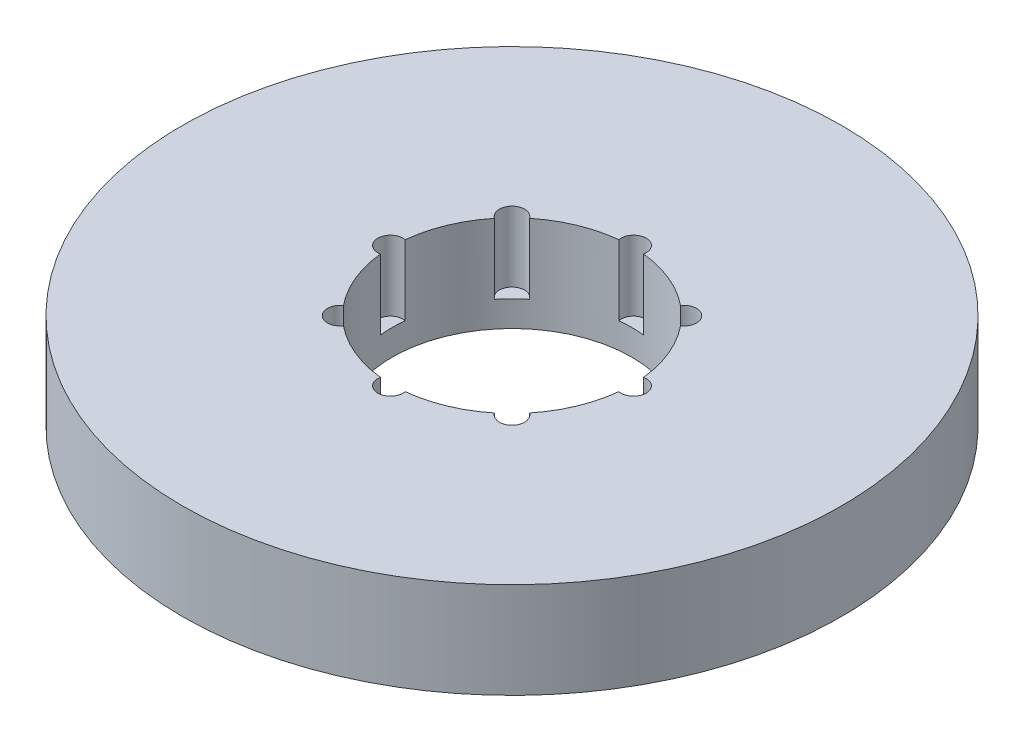
ISO-10303-21;
HEADER;
FILE_DESCRIPTION(('STEP AP214'),'2;1');
FILE_NAME('part.step','',(''),(''),'','','');
FILE_SCHEMA(('AUTOMOTIVE_DESIGN { 1 0 10303 214 1 1 1 1 }'));
ENDSEC;
DATA;
#1=APPLICATION_CONTEXT('core data for automotive mechanical design processes');
#2=APPLICATION_PROTOCOL_DEFINITION('international standard','automotive_design',2000,#1);
#3=PRODUCT_CONTEXT('',#1,'mechanical');
#4=PRODUCT('Part','Part','',(#3));
#5=PRODUCT_RELATED_PRODUCT_CATEGORY('part','',(#4));
#6=PRODUCT_DEFINITION_FORMATION('','',#4);
#7=PRODUCT_DEFINITION_CONTEXT('part definition',#1,'design');
#8=PRODUCT_DEFINITION('design','',#6,#7);
#9=PRODUCT_DEFINITION_SHAPE('','',#8);
#10=(LENGTH_UNIT() NAMED_UNIT(*) SI_UNIT(.MILLI.,.METRE.));
#11=(NAMED_UNIT(*) PLANE_ANGLE_UNIT() SI_UNIT($,.RADIAN.));
#12=(NAMED_UNIT(*) SI_UNIT($,.STERADIAN.) SOLID_ANGLE_UNIT());
#13=UNCERTAINTY_MEASURE_WITH_UNIT(LENGTH_MEASURE(1.E-05),#10,'distance_accuracy_value','');
#14=(GEOMETRIC_REPRESENTATION_CONTEXT(3) GLOBAL_UNCERTAINTY_ASSIGNED_CONTEXT((#13)) GLOBAL_UNIT_ASSIGNED_CONTEXT((#10,
#11,#12)) REPRESENTATION_CONTEXT('',''));
#15=CARTESIAN_POINT('',(0.,0.,0.));
#16=DIRECTION('',(0.,0.,1.));
#17=DIRECTION('',(1.,0.,0.));
#18=AXIS2_PLACEMENT_3D('',#15,#16,#17);
#19=CARTESIAN_POINT('',(0.,24.,0.));
#20=DIRECTION('',(0.,-1.,0.));
#21=DIRECTION('',(0.,0.,-1.));
#22=AXIS2_PLACEMENT_3D('',#19,#20,#21);
#23=CYLINDRICAL_SURFACE('',#22,82.5);
#24=CARTESIAN_POINT('',(0.,24.,0.));
#25=DIRECTION('',(0.,1.,0.));
#26=DIRECTION('',(0.,0.,1.));
#27=AXIS2_PLACEMENT_3D('',#24,#25,#26);
#28=CIRCLE('',#27,82.5);
#29=CARTESIAN_POINT('',(0.,24.,82.5));
#30=VERTEX_POINT('',#29);
#31=EDGE_CURVE('E195',#30,#30,#28,.T.);
#32=ORIENTED_EDGE('',*,*,#31,.F.);
#33=EDGE_LOOP('',(#32));
#34=FACE_BOUND('',#33,.T.);
#35=CARTESIAN_POINT('',(0.,0.,0.));
#36=DIRECTION('',(0.,1.,0.));
#37=DIRECTION('',(0.,0.,1.));
#38=AXIS2_PLACEMENT_3D('',#35,#36,#37);
#39=CIRCLE('',#38,82.5);
#40=CARTESIAN_POINT('',(0.,0.,82.5));
#41=VERTEX_POINT('',#40);
#42=EDGE_CURVE('E179',#41,#41,#39,.T.);
#43=ORIENTED_EDGE('',*,*,#42,.T.);
#44=EDGE_LOOP('',(#43));
#45=FACE_BOUND('',#44,.T.);
#46=ADVANCED_FACE('F39',(#34,#45),#23,.T.);
#47=CARTESIAN_POINT('',(0.,24.,0.));
#48=DIRECTION('',(0.,1.,0.));
#49=DIRECTION('',(0.,0.,1.));
#50=AXIS2_PLACEMENT_3D('',#47,#48,#49);
#51=PLANE('',#50);
#52=CARTESIAN_POINT('',(1.06241217838376E-13,24.,30.4286941638297));
#53=DIRECTION('',(0.,1.,0.));
#54=DIRECTION('',(1.,0.,0.));
#55=AXIS2_PLACEMENT_3D('',#52,#53,#54);
#56=CIRCLE('',#55,3.16391885631656);
#57=CARTESIAN_POINT('',(-3.10839018443666,24.,29.8385306350916));
#58=VERTEX_POINT('',#57);
#59=CARTESIAN_POINT('',(3.10839018443687,24.,29.8385306350915));
#60=VERTEX_POINT('',#59);
#61=EDGE_CURVE('E176',#58,#60,#56,.T.);
#62=ORIENTED_EDGE('',*,*,#61,.F.);
#63=CARTESIAN_POINT('',(0.,24.,0.));
#64=DIRECTION('',(0.,1.,0.));
#65=DIRECTION('',(0.,0.,1.));
#66=AXIS2_PLACEMENT_3D('',#63,#64,#65);
#67=CIRCLE('',#66,30.);
#68=CARTESIAN_POINT('',(-18.9010635747268,24.,23.2969911307048));
#69=VERTEX_POINT('',#68);
#70=EDGE_CURVE('E166',#69,#58,#67,.T.);
#71=ORIENTED_EDGE('',*,*,#70,.F.);
#72=CARTESIAN_POINT('',(-21.5163359858955,24.,21.5163359858956));
#73=DIRECTION('',(0.,1.,0.));
#74=DIRECTION('',(0.707106781186549,0.,0.707106781186546));
#75=AXIS2_PLACEMENT_3D('',#72,#73,#74);
#76=CIRCLE('',#75,3.16391885631656);
#77=CARTESIAN_POINT('',(-23.2969911307047,24.,18.9010635747269));
#78=VERTEX_POINT('',#77);
#79=EDGE_CURVE('E147',#78,#69,#76,.T.);
#80=ORIENTED_EDGE('',*,*,#79,.F.);
#81=CARTESIAN_POINT('',(-29.8385306350916,24.,3.10839018443676));
#82=VERTEX_POINT('',#81);
#83=EDGE_CURVE('E180',#82,#78,#67,.T.);
#84=ORIENTED_EDGE('',*,*,#83,.F.);
#85=CARTESIAN_POINT('',(-30.4286941638297,24.,0.));
#86=DIRECTION('',(0.,1.,0.));
#87=DIRECTION('',(0.,0.,1.));
#88=AXIS2_PLACEMENT_3D('',#85,#86,#87);
#89=CIRCLE('',#88,3.16391885631656);
#90=CARTESIAN_POINT('',(-29.8385306350916,24.,-3.10839018443676));
#91=VERTEX_POINT('',#90);
#92=EDGE_CURVE('E186',#91,#82,#89,.T.);
#93=ORIENTED_EDGE('',*,*,#92,.F.);
#94=CARTESIAN_POINT('',(-23.2969911307049,24.,-18.9010635747266));
#95=VERTEX_POINT('',#94);
#96=EDGE_CURVE('E182',#95,#91,#67,.T.);
#97=ORIENTED_EDGE('',*,*,#96,.F.);
#98=CARTESIAN_POINT('',(-21.5163359858958,24.,-21.5163359858952));
#99=DIRECTION('',(0.,1.,0.));
#100=DIRECTION('',(-0.707106781186539,0.,0.707106781186556));
#101=AXIS2_PLACEMENT_3D('',#98,#99,#100);
#102=CIRCLE('',#101,3.16391885631656);
#103=CARTESIAN_POINT('',(-18.9010635747271,24.,-23.2969911307045));
#104=VERTEX_POINT('',#103);
#105=EDGE_CURVE('E446',#104,#95,#102,.T.);
#106=ORIENTED_EDGE('',*,*,#105,.F.);
#107=CARTESIAN_POINT('',(-3.10839018443708,24.,-29.8385306350915));
#108=VERTEX_POINT('',#107);
#109=EDGE_CURVE('E452',#108,#104,#67,.T.);
#110=ORIENTED_EDGE('',*,*,#109,.F.);
#111=CARTESIAN_POINT('',(-3.18723653515129E-13,24.,-30.4286941638297));
#112=DIRECTION('',(0.,1.,0.));
#113=DIRECTION('',(-1.,0.,0.));
#114=AXIS2_PLACEMENT_3D('',#111,#112,#113);
#115=CIRCLE('',#114,3.16391885631656);
#116=CARTESIAN_POINT('',(3.10839018443645,24.,-29.8385306350916));
#117=VERTEX_POINT('',#116);
#118=EDGE_CURVE('E477',#117,#108,#115,.T.);
#119=ORIENTED_EDGE('',*,*,#118,.F.);
#120=CARTESIAN_POINT('',(18.9010635747266,24.,-23.2969911307049));
#121=VERTEX_POINT('',#120);
#122=EDGE_CURVE('E460',#121,#117,#67,.T.);
#123=ORIENTED_EDGE('',*,*,#122,.F.);
#124=CARTESIAN_POINT('',(21.5163359858953,24.,-21.5163359858957));
#125=DIRECTION('',(0.,1.,0.));
#126=DIRECTION('',(-0.707106781186554,0.,-0.707106781186541));
#127=AXIS2_PLACEMENT_3D('',#124,#125,#126);
#128=CIRCLE('',#127,3.16391885631656);
#129=CARTESIAN_POINT('',(23.2969911307046,24.,-18.901063574727));
#130=VERTEX_POINT('',#129);
#131=EDGE_CURVE('E464',#130,#121,#128,.T.);
#132=ORIENTED_EDGE('',*,*,#131,.F.);
#133=CARTESIAN_POINT('',(29.8385306350916,24.,-3.10839018443676));
#134=VERTEX_POINT('',#133);
#135=EDGE_CURVE('E459',#134,#130,#67,.T.);
#136=ORIENTED_EDGE('',*,*,#135,.F.);
#137=CARTESIAN_POINT('',(30.4286941638297,24.,0.));
#138=DIRECTION('',(0.,1.,0.));
#139=DIRECTION('',(0.,0.,-1.));
#140=AXIS2_PLACEMENT_3D('',#137,#138,#139);
#141=CIRCLE('',#140,3.16391885631656);
#142=CARTESIAN_POINT('',(29.8385306350916,24.,3.10839018443676));
#143=VERTEX_POINT('',#142);
#144=EDGE_CURVE('E469',#143,#134,#141,.T.);
#145=ORIENTED_EDGE('',*,*,#144,.F.);
#146=CARTESIAN_POINT('',(23.2969911307048,24.,18.9010635747267));
#147=VERTEX_POINT('',#146);
#148=EDGE_CURVE('E181',#147,#143,#67,.T.);
#149=ORIENTED_EDGE('',*,*,#148,.F.);
#150=CARTESIAN_POINT('',(21.5163359858956,24.,21.5163359858954));
#151=DIRECTION('',(0.,1.,0.));
#152=DIRECTION('',(0.707106781186544,0.,-0.707106781186551));
#153=AXIS2_PLACEMENT_3D('',#150,#151,#152);
#154=CIRCLE('',#153,3.16391885631656);
#155=CARTESIAN_POINT('',(18.901063574727,24.,23.2969911307046));
#156=VERTEX_POINT('',#155);
#157=EDGE_CURVE('E475',#156,#147,#154,.T.);
#158=ORIENTED_EDGE('',*,*,#157,.F.);
#159=EDGE_CURVE('E177',#60,#156,#67,.T.);
#160=ORIENTED_EDGE('',*,*,#159,.F.);
#161=EDGE_LOOP('',(#62,#71,#80,#84,#93,#97,#106,#110,#119,#123,#132,#136,#145,#149,#158,#160));
#162=FACE_BOUND('',#161,.T.);
#163=ORIENTED_EDGE('',*,*,#31,.T.);
#164=EDGE_LOOP('',(#163));
#165=FACE_BOUND('',#164,.T.);
#166=ADVANCED_FACE('F172',(#162,#165),#51,.T.);
#167=CARTESIAN_POINT('',(0.,0.,0.));
#168=DIRECTION('',(0.,1.,0.));
#169=DIRECTION('',(0.,0.,1.));
#170=AXIS2_PLACEMENT_3D('',#167,#168,#169);
#171=PLANE('',#170);
#172=CARTESIAN_POINT('',(0.,0.,0.));
#173=DIRECTION('',(0.,1.,0.));
#174=DIRECTION('',(0.,0.,1.));
#175=AXIS2_PLACEMENT_3D('',#172,#173,#174);
#176=CIRCLE('',#175,30.);
#177=CARTESIAN_POINT('',(0.,0.,30.));
#178=VERTEX_POINT('',#177);
#179=EDGE_CURVE('E187',#178,#178,#176,.T.);
#180=ORIENTED_EDGE('',*,*,#179,.T.);
#181=EDGE_LOOP('',(#180));
#182=FACE_BOUND('',#181,.T.);
#183=ORIENTED_EDGE('',*,*,#42,.F.);
#184=EDGE_LOOP('',(#183));
#185=FACE_BOUND('',#184,.T.);
#186=ADVANCED_FACE('F270',(#182,#185),#171,.F.);
#187=CARTESIAN_POINT('',(0.,24.,0.));
#188=DIRECTION('',(0.,-1.,0.));
#189=DIRECTION('',(0.,0.,-1.));
#190=AXIS2_PLACEMENT_3D('',#187,#188,#189);
#191=CYLINDRICAL_SURFACE('',#190,30.);
#192=DIRECTION('',(0.,1.,0.));
#193=VECTOR('',#192,1.);
#194=CARTESIAN_POINT('',(-3.10839018443666,15.2189288393925,29.8385306350916));
#195=LINE('',#194,#193);
#196=CARTESIAN_POINT('',(-3.10839018443666,6.43785767878499,29.8385306350916));
#197=VERTEX_POINT('',#196);
#198=EDGE_CURVE('E11',#197,#58,#195,.T.);
#199=ORIENTED_EDGE('',*,*,#198,.F.);
#200=CARTESIAN_POINT('',(0.,6.43785767878499,0.));
#201=DIRECTION('',(0.,1.,0.));
#202=DIRECTION('',(0.,0.,1.));
#203=AXIS2_PLACEMENT_3D('',#200,#201,#202);
#204=CIRCLE('',#203,30.);
#205=CARTESIAN_POINT('',(3.10839018443687,6.43785767878499,29.8385306350915));
#206=VERTEX_POINT('',#205);
#207=EDGE_CURVE('E250',#197,#206,#204,.T.);
#208=ORIENTED_EDGE('',*,*,#207,.T.);
#209=DIRECTION('',(0.,1.,0.));
#210=VECTOR('',#209,1.);
#211=CARTESIAN_POINT('',(3.10839018443687,15.2189288393925,29.8385306350915));
#212=LINE('',#211,#210);
#213=EDGE_CURVE('E46',#60,#206,#212,.F.);
#214=ORIENTED_EDGE('',*,*,#213,.F.);
#215=ORIENTED_EDGE('',*,*,#159,.T.);
#216=DIRECTION('',(0.,1.,0.));
#217=VECTOR('',#216,1.);
#218=CARTESIAN_POINT('',(18.901063574727,15.2189288393925,23.2969911307046));
#219=LINE('',#218,#217);
#220=CARTESIAN_POINT('',(18.901063574727,6.43785767878499,23.2969911307046));
#221=VERTEX_POINT('',#220);
#222=EDGE_CURVE('E244',#221,#156,#219,.T.);
#223=ORIENTED_EDGE('',*,*,#222,.F.);
#224=CARTESIAN_POINT('',(0.,6.43785767878499,0.));
#225=DIRECTION('',(0.,1.,0.));
#226=DIRECTION('',(0.,0.,1.));
#227=AXIS2_PLACEMENT_3D('',#224,#225,#226);
#228=CIRCLE('',#227,30.);
#229=CARTESIAN_POINT('',(23.2969911307048,6.43785767878499,18.9010635747267));
#230=VERTEX_POINT('',#229);
#231=EDGE_CURVE('E238',#221,#230,#228,.T.);
#232=ORIENTED_EDGE('',*,*,#231,.T.);
#233=DIRECTION('',(0.,1.,0.));
#234=VECTOR('',#233,1.);
#235=CARTESIAN_POINT('',(23.2969911307048,15.2189288393925,18.9010635747267));
#236=LINE('',#235,#234);
#237=EDGE_CURVE('E242',#147,#230,#236,.F.);
#238=ORIENTED_EDGE('',*,*,#237,.F.);
#239=ORIENTED_EDGE('',*,*,#148,.T.);
#240=DIRECTION('',(0.,1.,0.));
#241=VECTOR('',#240,1.);
#242=CARTESIAN_POINT('',(29.8385306350916,15.2189288393925,3.10839018443676));
#243=LINE('',#242,#241);
#244=CARTESIAN_POINT('',(29.8385306350916,6.43785767878499,3.10839018443676));
#245=VERTEX_POINT('',#244);
#246=EDGE_CURVE('E236',#245,#143,#243,.T.);
#247=ORIENTED_EDGE('',*,*,#246,.F.);
#248=CARTESIAN_POINT('',(0.,6.43785767878499,0.));
#249=DIRECTION('',(0.,1.,0.));
#250=DIRECTION('',(0.,0.,1.));
#251=AXIS2_PLACEMENT_3D('',#248,#249,#250);
#252=CIRCLE('',#251,30.);
#253=CARTESIAN_POINT('',(29.8385306350916,6.43785767878499,-3.10839018443676));
#254=VERTEX_POINT('',#253);
#255=EDGE_CURVE('E235',#245,#254,#252,.T.);
#256=ORIENTED_EDGE('',*,*,#255,.T.);
#257=DIRECTION('',(0.,1.,0.));
#258=VECTOR('',#257,1.);
#259=CARTESIAN_POINT('',(29.8385306350916,15.2189288393925,-3.10839018443676));
#260=LINE('',#259,#258);
#261=EDGE_CURVE('E234',#134,#254,#260,.F.);
#262=ORIENTED_EDGE('',*,*,#261,.F.);
#263=ORIENTED_EDGE('',*,*,#135,.T.);
#264=DIRECTION('',(0.,1.,0.));
#265=VECTOR('',#264,1.);
#266=CARTESIAN_POINT('',(23.2969911307046,15.2189288393925,-18.901063574727));
#267=LINE('',#266,#265);
#268=CARTESIAN_POINT('',(23.2969911307046,6.43785767878499,-18.901063574727));
#269=VERTEX_POINT('',#268);
#270=EDGE_CURVE('E229',#269,#130,#267,.T.);
#271=ORIENTED_EDGE('',*,*,#270,.F.);
#272=CARTESIAN_POINT('',(0.,6.43785767878499,0.));
#273=DIRECTION('',(0.,1.,0.));
#274=DIRECTION('',(0.,0.,1.));
#275=AXIS2_PLACEMENT_3D('',#272,#273,#274);
#276=CIRCLE('',#275,30.);
#277=CARTESIAN_POINT('',(18.9010635747266,6.43785767878499,-23.2969911307049));
#278=VERTEX_POINT('',#277);
#279=EDGE_CURVE('E221',#269,#278,#276,.T.);
#280=ORIENTED_EDGE('',*,*,#279,.T.);
#281=DIRECTION('',(0.,1.,0.));
#282=VECTOR('',#281,1.);
#283=CARTESIAN_POINT('',(18.9010635747266,15.2189288393925,-23.2969911307049));
#284=LINE('',#283,#282);
#285=EDGE_CURVE('E230',#121,#278,#284,.F.);
#286=ORIENTED_EDGE('',*,*,#285,.F.);
#287=ORIENTED_EDGE('',*,*,#122,.T.);
#288=DIRECTION('',(0.,1.,0.));
#289=VECTOR('',#288,1.);
#290=CARTESIAN_POINT('',(3.10839018443645,15.2189288393925,-29.8385306350916));
#291=LINE('',#290,#289);
#292=CARTESIAN_POINT('',(3.10839018443645,6.43785767878499,-29.8385306350916));
#293=VERTEX_POINT('',#292);
#294=EDGE_CURVE('E225',#293,#117,#291,.T.);
#295=ORIENTED_EDGE('',*,*,#294,.F.);
#296=CARTESIAN_POINT('',(0.,6.43785767878499,0.));
#297=DIRECTION('',(0.,1.,0.));
#298=DIRECTION('',(0.,0.,1.));
#299=AXIS2_PLACEMENT_3D('',#296,#297,#298);
#300=CIRCLE('',#299,30.);
#301=CARTESIAN_POINT('',(-3.10839018443708,6.43785767878499,-29.8385306350915));
#302=VERTEX_POINT('',#301);
#303=EDGE_CURVE('E216',#293,#302,#300,.T.);
#304=ORIENTED_EDGE('',*,*,#303,.T.);
#305=DIRECTION('',(0.,1.,0.));
#306=VECTOR('',#305,1.);
#307=CARTESIAN_POINT('',(-3.10839018443708,15.2189288393925,-29.8385306350915));
#308=LINE('',#307,#306);
#309=EDGE_CURVE('E218',#108,#302,#308,.F.);
#310=ORIENTED_EDGE('',*,*,#309,.F.);
#311=ORIENTED_EDGE('',*,*,#109,.T.);
#312=DIRECTION('',(0.,1.,0.));
#313=VECTOR('',#312,1.);
#314=CARTESIAN_POINT('',(-18.9010635747271,15.2189288393925,-23.2969911307045));
#315=LINE('',#314,#313);
#316=CARTESIAN_POINT('',(-18.9010635747271,6.43785767878499,-23.2969911307045));
#317=VERTEX_POINT('',#316);
#318=EDGE_CURVE('E212',#317,#104,#315,.T.);
#319=ORIENTED_EDGE('',*,*,#318,.F.);
#320=CARTESIAN_POINT('',(0.,6.43785767878499,0.));
#321=DIRECTION('',(0.,1.,0.));
#322=DIRECTION('',(0.,0.,1.));
#323=AXIS2_PLACEMENT_3D('',#320,#321,#322);
#324=CIRCLE('',#323,30.);
#325=CARTESIAN_POINT('',(-23.2969911307049,6.43785767878499,-18.9010635747266));
#326=VERTEX_POINT('',#325);
#327=EDGE_CURVE('E208',#317,#326,#324,.T.);
#328=ORIENTED_EDGE('',*,*,#327,.T.);
#329=DIRECTION('',(0.,1.,0.));
#330=VECTOR('',#329,1.);
#331=CARTESIAN_POINT('',(-23.2969911307049,15.2189288393925,-18.9010635747266));
#332=LINE('',#331,#330);
#333=EDGE_CURVE('E211',#95,#326,#332,.F.);
#334=ORIENTED_EDGE('',*,*,#333,.F.);
#335=ORIENTED_EDGE('',*,*,#96,.T.);
#336=DIRECTION('',(0.,1.,0.));
#337=VECTOR('',#336,1.);
#338=CARTESIAN_POINT('',(-29.8385306350916,15.2189288393925,-3.10839018443676));
#339=LINE('',#338,#337);
#340=CARTESIAN_POINT('',(-29.8385306350916,6.43785767878499,-3.10839018443676));
#341=VERTEX_POINT('',#340);
#342=EDGE_CURVE('E201',#341,#91,#339,.T.);
#343=ORIENTED_EDGE('',*,*,#342,.F.);
#344=CARTESIAN_POINT('',(0.,6.43785767878499,0.));
#345=DIRECTION('',(0.,1.,0.));
#346=DIRECTION('',(0.,0.,1.));
#347=AXIS2_PLACEMENT_3D('',#344,#345,#346);
#348=CIRCLE('',#347,30.);
#349=CARTESIAN_POINT('',(-29.8385306350916,6.43785767878499,3.10839018443676));
#350=VERTEX_POINT('',#349);
#351=EDGE_CURVE('E194',#341,#350,#348,.T.);
#352=ORIENTED_EDGE('',*,*,#351,.T.);
#353=DIRECTION('',(0.,1.,0.));
#354=VECTOR('',#353,1.);
#355=CARTESIAN_POINT('',(-29.8385306350916,15.2189288393925,3.10839018443676));
#356=LINE('',#355,#354);
#357=EDGE_CURVE('E199',#82,#350,#356,.F.);
#358=ORIENTED_EDGE('',*,*,#357,.F.);
#359=ORIENTED_EDGE('',*,*,#83,.T.);
#360=DIRECTION('',(0.,1.,0.));
#361=VECTOR('',#360,1.);
#362=CARTESIAN_POINT('',(-23.2969911307047,15.2189288393925,18.9010635747269));
#363=LINE('',#362,#361);
#364=CARTESIAN_POINT('',(-23.2969911307047,6.43785767878499,18.9010635747269));
#365=VERTEX_POINT('',#364);
#366=EDGE_CURVE('E160',#365,#78,#363,.T.);
#367=ORIENTED_EDGE('',*,*,#366,.F.);
#368=CARTESIAN_POINT('',(0.,6.43785767878499,0.));
#369=DIRECTION('',(0.,1.,0.));
#370=DIRECTION('',(0.,0.,1.));
#371=AXIS2_PLACEMENT_3D('',#368,#369,#370);
#372=CIRCLE('',#371,30.);
#373=CARTESIAN_POINT('',(-18.9010635747268,6.43785767878499,23.2969911307048));
#374=VERTEX_POINT('',#373);
#375=EDGE_CURVE('E168',#365,#374,#372,.T.);
#376=ORIENTED_EDGE('',*,*,#375,.T.);
#377=DIRECTION('',(0.,1.,0.));
#378=VECTOR('',#377,1.);
#379=CARTESIAN_POINT('',(-18.9010635747268,15.2189288393925,23.2969911307047));
#380=LINE('',#379,#378);
#381=EDGE_CURVE('E152',#69,#374,#380,.F.);
#382=ORIENTED_EDGE('',*,*,#381,.F.);
#383=ORIENTED_EDGE('',*,*,#70,.T.);
#384=EDGE_LOOP('',(#199,#208,#214,#215,#223,#232,#238,#239,#247,#256,#262,#263,#271,#280,#286,
#287,#295,#304,#310,#311,#319,#328,#334,#335,#343,#352,#358,#359,#367,#376,#382,#383));
#385=FACE_BOUND('',#384,.T.);
#386=ORIENTED_EDGE('',*,*,#179,.F.);
#387=EDGE_LOOP('',(#386));
#388=FACE_BOUND('',#387,.T.);
#389=ADVANCED_FACE('F170',(#385,#388),#191,.F.);
#390=CARTESIAN_POINT('',(-30.4286941638297,6.43785767878499,0.));
#391=DIRECTION('',(0.,1.,0.));
#392=DIRECTION('',(0.,0.,1.));
#393=AXIS2_PLACEMENT_3D('',#390,#391,#392);
#394=CYLINDRICAL_SURFACE('',#393,3.16391885631656);
#395=ORIENTED_EDGE('',*,*,#342,.T.);
#396=ORIENTED_EDGE('',*,*,#92,.T.);
#397=ORIENTED_EDGE('',*,*,#357,.T.);
#398=CARTESIAN_POINT('',(-30.4286941638297,6.43785767878499,0.));
#399=DIRECTION('',(0.,1.,0.));
#400=DIRECTION('',(0.,0.,1.));
#401=AXIS2_PLACEMENT_3D('',#398,#399,#400);
#402=CIRCLE('',#401,3.16391885631656);
#403=EDGE_CURVE('E191',#341,#350,#402,.T.);
#404=ORIENTED_EDGE('',*,*,#403,.F.);
#405=EDGE_LOOP('',(#395,#396,#397,#404));
#406=FACE_BOUND('',#405,.T.);
#407=ADVANCED_FACE('F279',(#406),#394,.F.);
#408=CARTESIAN_POINT('',(-30.4286941638297,6.43785767878499,0.));
#409=DIRECTION('',(0.,1.,0.));
#410=DIRECTION('',(0.,0.,1.));
#411=AXIS2_PLACEMENT_3D('',#408,#409,#410);
#412=PLANE('',#411);
#413=ORIENTED_EDGE('',*,*,#403,.T.);
#414=ORIENTED_EDGE('',*,*,#351,.F.);
#415=EDGE_LOOP('',(#413,#414));
#416=FACE_BOUND('',#415,.T.);
#417=ADVANCED_FACE('F285',(#416),#412,.T.);
#418=CARTESIAN_POINT('',(-21.5163359858955,6.43785767878499,21.5163359858956));
#419=DIRECTION('',(0.,1.,0.));
#420=DIRECTION('',(0.,0.,1.));
#421=AXIS2_PLACEMENT_3D('',#418,#419,#420);
#422=CYLINDRICAL_SURFACE('',#421,3.16391885631656);
#423=ORIENTED_EDGE('',*,*,#366,.T.);
#424=ORIENTED_EDGE('',*,*,#79,.T.);
#425=ORIENTED_EDGE('',*,*,#381,.T.);
#426=CARTESIAN_POINT('',(-21.5163359858955,6.43785767878499,21.5163359858956));
#427=DIRECTION('',(0.,1.,0.));
#428=DIRECTION('',(0.707106781186549,0.,0.707106781186546));
#429=AXIS2_PLACEMENT_3D('',#426,#427,#428);
#430=CIRCLE('',#429,3.16391885631656);
#431=EDGE_CURVE('E165',#365,#374,#430,.T.);
#432=ORIENTED_EDGE('',*,*,#431,.F.);
#433=EDGE_LOOP('',(#423,#424,#425,#432));
#434=FACE_BOUND('',#433,.T.);
#435=ADVANCED_FACE('F155',(#434),#422,.F.);
#436=CARTESIAN_POINT('',(-21.5163359858955,6.43785767878499,21.5163359858956));
#437=DIRECTION('',(0.,1.,0.));
#438=DIRECTION('',(0.707106781186549,0.,0.707106781186546));
#439=AXIS2_PLACEMENT_3D('',#436,#437,#438);
#440=PLANE('',#439);
#441=ORIENTED_EDGE('',*,*,#431,.T.);
#442=ORIENTED_EDGE('',*,*,#375,.F.);
#443=EDGE_LOOP('',(#441,#442));
#444=FACE_BOUND('',#443,.T.);
#445=ADVANCED_FACE('F288',(#444),#440,.T.);
#446=CARTESIAN_POINT('',(-21.5163359858958,6.43785767878499,-21.5163359858952));
#447=DIRECTION('',(0.,1.,0.));
#448=DIRECTION('',(0.,0.,1.));
#449=AXIS2_PLACEMENT_3D('',#446,#447,#448);
#450=CYLINDRICAL_SURFACE('',#449,3.16391885631656);
#451=ORIENTED_EDGE('',*,*,#318,.T.);
#452=ORIENTED_EDGE('',*,*,#105,.T.);
#453=ORIENTED_EDGE('',*,*,#333,.T.);
#454=CARTESIAN_POINT('',(-21.5163359858958,6.43785767878499,-21.5163359858952));
#455=DIRECTION('',(0.,1.,0.));
#456=DIRECTION('',(-0.707106781186539,0.,0.707106781186556));
#457=AXIS2_PLACEMENT_3D('',#454,#455,#456);
#458=CIRCLE('',#457,3.16391885631656);
#459=EDGE_CURVE('E447',#317,#326,#458,.T.);
#460=ORIENTED_EDGE('',*,*,#459,.F.);
#461=EDGE_LOOP('',(#451,#452,#453,#460));
#462=FACE_BOUND('',#461,.T.);
#463=ADVANCED_FACE('F295',(#462),#450,.F.);
#464=CARTESIAN_POINT('',(-21.5163359858958,6.43785767878499,-21.5163359858952));
#465=DIRECTION('',(0.,1.,0.));
#466=DIRECTION('',(-0.707106781186539,0.,0.707106781186556));
#467=AXIS2_PLACEMENT_3D('',#464,#465,#466);
#468=PLANE('',#467);
#469=ORIENTED_EDGE('',*,*,#459,.T.);
#470=ORIENTED_EDGE('',*,*,#327,.F.);
#471=EDGE_LOOP('',(#469,#470));
#472=FACE_BOUND('',#471,.T.);
#473=ADVANCED_FACE('F375',(#472),#468,.T.);
#474=CARTESIAN_POINT('',(-3.18723653515129E-13,6.43785767878499,-30.4286941638297));
#475=DIRECTION('',(0.,1.,0.));
#476=DIRECTION('',(0.,0.,1.));
#477=AXIS2_PLACEMENT_3D('',#474,#475,#476);
#478=CYLINDRICAL_SURFACE('',#477,3.16391885631656);
#479=ORIENTED_EDGE('',*,*,#294,.T.);
#480=ORIENTED_EDGE('',*,*,#118,.T.);
#481=ORIENTED_EDGE('',*,*,#309,.T.);
#482=CARTESIAN_POINT('',(-3.18723653515129E-13,6.43785767878499,-30.4286941638297));
#483=DIRECTION('',(0.,1.,0.));
#484=DIRECTION('',(-1.,0.,0.));
#485=AXIS2_PLACEMENT_3D('',#482,#483,#484);
#486=CIRCLE('',#485,3.16391885631656);
#487=EDGE_CURVE('E467',#293,#302,#486,.T.);
#488=ORIENTED_EDGE('',*,*,#487,.F.);
#489=EDGE_LOOP('',(#479,#480,#481,#488));
#490=FACE_BOUND('',#489,.T.);
#491=ADVANCED_FACE('F361',(#490),#478,.F.);
#492=CARTESIAN_POINT('',(-3.18723653515129E-13,6.43785767878499,-30.4286941638297));
#493=DIRECTION('',(0.,1.,0.));
#494=DIRECTION('',(-1.,0.,0.));
#495=AXIS2_PLACEMENT_3D('',#492,#493,#494);
#496=PLANE('',#495);
#497=ORIENTED_EDGE('',*,*,#487,.T.);
#498=ORIENTED_EDGE('',*,*,#303,.F.);
#499=EDGE_LOOP('',(#497,#498));
#500=FACE_BOUND('',#499,.T.);
#501=ADVANCED_FACE('F297',(#500),#496,.T.);
#502=CARTESIAN_POINT('',(21.5163359858953,6.43785767878499,-21.5163359858957));
#503=DIRECTION('',(0.,1.,0.));
#504=DIRECTION('',(0.,0.,1.));
#505=AXIS2_PLACEMENT_3D('',#502,#503,#504);
#506=CYLINDRICAL_SURFACE('',#505,3.16391885631656);
#507=ORIENTED_EDGE('',*,*,#270,.T.);
#508=ORIENTED_EDGE('',*,*,#131,.T.);
#509=ORIENTED_EDGE('',*,*,#285,.T.);
#510=CARTESIAN_POINT('',(21.5163359858953,6.43785767878499,-21.5163359858957));
#511=DIRECTION('',(0.,1.,0.));
#512=DIRECTION('',(-0.707106781186554,0.,-0.707106781186541));
#513=AXIS2_PLACEMENT_3D('',#510,#511,#512);
#514=CIRCLE('',#513,3.16391885631656);
#515=EDGE_CURVE('E470',#269,#278,#514,.T.);
#516=ORIENTED_EDGE('',*,*,#515,.F.);
#517=EDGE_LOOP('',(#507,#508,#509,#516));
#518=FACE_BOUND('',#517,.T.);
#519=ADVANCED_FACE('F294',(#518),#506,.F.);
#520=CARTESIAN_POINT('',(21.5163359858953,6.43785767878499,-21.5163359858957));
#521=DIRECTION('',(0.,1.,0.));
#522=DIRECTION('',(-0.707106781186554,0.,-0.707106781186541));
#523=AXIS2_PLACEMENT_3D('',#520,#521,#522);
#524=PLANE('',#523);
#525=ORIENTED_EDGE('',*,*,#515,.T.);
#526=ORIENTED_EDGE('',*,*,#279,.F.);
#527=EDGE_LOOP('',(#525,#526));
#528=FACE_BOUND('',#527,.T.);
#529=ADVANCED_FACE('F300',(#528),#524,.T.);
#530=CARTESIAN_POINT('',(30.4286941638297,6.43785767878499,0.));
#531=DIRECTION('',(0.,1.,0.));
#532=DIRECTION('',(0.,0.,1.));
#533=AXIS2_PLACEMENT_3D('',#530,#531,#532);
#534=CYLINDRICAL_SURFACE('',#533,3.16391885631656);
#535=ORIENTED_EDGE('',*,*,#246,.T.);
#536=ORIENTED_EDGE('',*,*,#144,.T.);
#537=ORIENTED_EDGE('',*,*,#261,.T.);
#538=CARTESIAN_POINT('',(30.4286941638297,6.43785767878499,0.));
#539=DIRECTION('',(0.,1.,0.));
#540=DIRECTION('',(0.,0.,-1.));
#541=AXIS2_PLACEMENT_3D('',#538,#539,#540);
#542=CIRCLE('',#541,3.16391885631656);
#543=EDGE_CURVE('E472',#245,#254,#542,.T.);
#544=ORIENTED_EDGE('',*,*,#543,.F.);
#545=EDGE_LOOP('',(#535,#536,#537,#544));
#546=FACE_BOUND('',#545,.T.);
#547=ADVANCED_FACE('F305',(#546),#534,.F.);
#548=CARTESIAN_POINT('',(30.4286941638297,6.43785767878499,0.));
#549=DIRECTION('',(0.,1.,0.));
#550=DIRECTION('',(0.,0.,-1.));
#551=AXIS2_PLACEMENT_3D('',#548,#549,#550);
#552=PLANE('',#551);
#553=ORIENTED_EDGE('',*,*,#543,.T.);
#554=ORIENTED_EDGE('',*,*,#255,.F.);
#555=EDGE_LOOP('',(#553,#554));
#556=FACE_BOUND('',#555,.T.);
#557=ADVANCED_FACE('F308',(#556),#552,.T.);
#558=CARTESIAN_POINT('',(21.5163359858956,6.43785767878499,21.5163359858954));
#559=DIRECTION('',(0.,1.,0.));
#560=DIRECTION('',(0.,0.,1.));
#561=AXIS2_PLACEMENT_3D('',#558,#559,#560);
#562=CYLINDRICAL_SURFACE('',#561,3.16391885631656);
#563=ORIENTED_EDGE('',*,*,#222,.T.);
#564=ORIENTED_EDGE('',*,*,#157,.T.);
#565=ORIENTED_EDGE('',*,*,#237,.T.);
#566=CARTESIAN_POINT('',(21.5163359858956,6.43785767878499,21.5163359858954));
#567=DIRECTION('',(0.,1.,0.));
#568=DIRECTION('',(0.707106781186544,0.,-0.707106781186551));
#569=AXIS2_PLACEMENT_3D('',#566,#567,#568);
#570=CIRCLE('',#569,3.16391885631656);
#571=EDGE_CURVE('E56',#221,#230,#570,.T.);
#572=ORIENTED_EDGE('',*,*,#571,.F.);
#573=EDGE_LOOP('',(#563,#564,#565,#572));
#574=FACE_BOUND('',#573,.T.);
#575=ADVANCED_FACE('F309',(#574),#562,.F.);
#576=CARTESIAN_POINT('',(21.5163359858956,6.43785767878499,21.5163359858954));
#577=DIRECTION('',(0.,1.,0.));
#578=DIRECTION('',(0.707106781186544,0.,-0.707106781186551));
#579=AXIS2_PLACEMENT_3D('',#576,#577,#578);
#580=PLANE('',#579);
#581=ORIENTED_EDGE('',*,*,#571,.T.);
#582=ORIENTED_EDGE('',*,*,#231,.F.);
#583=EDGE_LOOP('',(#581,#582));
#584=FACE_BOUND('',#583,.T.);
#585=ADVANCED_FACE('F256',(#584),#580,.T.);
#586=CARTESIAN_POINT('',(1.06241217838376E-13,6.43785767878499,30.4286941638297));
#587=DIRECTION('',(0.,1.,0.));
#588=DIRECTION('',(0.,0.,1.));
#589=AXIS2_PLACEMENT_3D('',#586,#587,#588);
#590=CYLINDRICAL_SURFACE('',#589,3.16391885631656);
#591=ORIENTED_EDGE('',*,*,#198,.T.);
#592=ORIENTED_EDGE('',*,*,#61,.T.);
#593=ORIENTED_EDGE('',*,*,#213,.T.);
#594=CARTESIAN_POINT('',(1.06241217838376E-13,6.43785767878499,30.4286941638297));
#595=DIRECTION('',(0.,1.,0.));
#596=DIRECTION('',(1.,0.,0.));
#597=AXIS2_PLACEMENT_3D('',#594,#595,#596);
#598=CIRCLE('',#597,3.16391885631656);
#599=EDGE_CURVE('E55',#197,#206,#598,.T.);
#600=ORIENTED_EDGE('',*,*,#599,.F.);
#601=EDGE_LOOP('',(#591,#592,#593,#600));
#602=FACE_BOUND('',#601,.T.);
#603=ADVANCED_FACE('F253',(#602),#590,.F.);
#604=CARTESIAN_POINT('',(1.06241217838376E-13,6.43785767878499,30.4286941638297));
#605=DIRECTION('',(0.,1.,0.));
#606=DIRECTION('',(1.,0.,0.));
#607=AXIS2_PLACEMENT_3D('',#604,#605,#606);
#608=PLANE('',#607);
#609=ORIENTED_EDGE('',*,*,#599,.T.);
#610=ORIENTED_EDGE('',*,*,#207,.F.);
#611=EDGE_LOOP('',(#609,#610));
#612=FACE_BOUND('',#611,.T.);
#613=ADVANCED_FACE('F252',(#612),#608,.T.);
#614=CLOSED_SHELL('',(#46,#166,#186,#389,#407,#417,#435,#445,#463,#473,#491,#501,#519,#529,#547,
#557,#575,#585,#603,#613));
#615=MANIFOLD_SOLID_BREP('B2',#614);
#616=ADVANCED_BREP_SHAPE_REPRESENTATION('',(#18,#615),#14);
#617=SHAPE_DEFINITION_REPRESENTATION(#9,#616);
ENDSEC;
END-ISO-10303-21;
